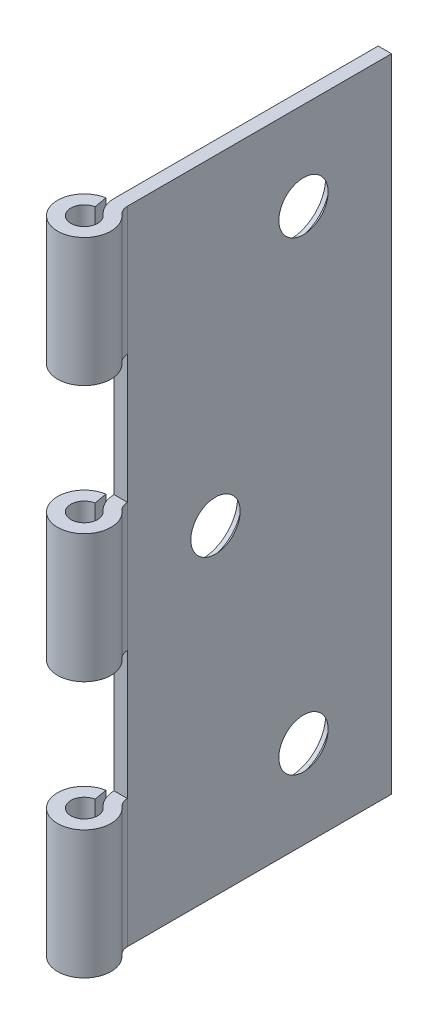
ISO-10303-21;
HEADER;
FILE_DESCRIPTION(('STEP AP214'),'2;1');
FILE_NAME('part.step','',(''),(''),'','','');
FILE_SCHEMA(('AUTOMOTIVE_DESIGN { 1 0 10303 214 1 1 1 1 }'));
ENDSEC;
DATA;
#1=APPLICATION_CONTEXT('core data for automotive mechanical design processes');
#2=APPLICATION_PROTOCOL_DEFINITION('international standard','automotive_design',2000,#1);
#3=PRODUCT_CONTEXT('',#1,'mechanical');
#4=PRODUCT('Part','Part','',(#3));
#5=PRODUCT_RELATED_PRODUCT_CATEGORY('part','',(#4));
#6=PRODUCT_DEFINITION_FORMATION('','',#4);
#7=PRODUCT_DEFINITION_CONTEXT('part definition',#1,'design');
#8=PRODUCT_DEFINITION('design','',#6,#7);
#9=PRODUCT_DEFINITION_SHAPE('','',#8);
#10=(LENGTH_UNIT() NAMED_UNIT(*) SI_UNIT(.MILLI.,.METRE.));
#11=(NAMED_UNIT(*) PLANE_ANGLE_UNIT() SI_UNIT($,.RADIAN.));
#12=(NAMED_UNIT(*) SI_UNIT($,.STERADIAN.) SOLID_ANGLE_UNIT());
#13=UNCERTAINTY_MEASURE_WITH_UNIT(LENGTH_MEASURE(1.E-05),#10,'distance_accuracy_value','');
#14=(GEOMETRIC_REPRESENTATION_CONTEXT(3) GLOBAL_UNCERTAINTY_ASSIGNED_CONTEXT((#13)) GLOBAL_UNIT_ASSIGNED_CONTEXT((#10,
#11,#12)) REPRESENTATION_CONTEXT('',''));
#15=CARTESIAN_POINT('',(0.,0.,0.));
#16=DIRECTION('',(0.,0.,1.));
#17=DIRECTION('',(1.,0.,0.));
#18=AXIS2_PLACEMENT_3D('',#15,#16,#17);
#19=CARTESIAN_POINT('',(3.175,38.1,-3.54975791428091));
#20=DIRECTION('',(0.,-1.,0.));
#21=DIRECTION('',(0.,0.,-1.));
#22=AXIS2_PLACEMENT_3D('',#19,#20,#21);
#23=CYLINDRICAL_SURFACE('',#22,3.175);
#24=DIRECTION('',(0.,-1.,0.));
#25=VECTOR('',#24,1.);
#26=CARTESIAN_POINT('',(0.,38.1,-3.54975791428091));
#27=LINE('',#26,#25);
#28=CARTESIAN_POINT('',(0.,7.62000000000002,-3.54975791428091));
#29=VERTEX_POINT('',#28);
#30=CARTESIAN_POINT('',(0.,-7.61999999999995,-3.54975791428091));
#31=VERTEX_POINT('',#30);
#32=EDGE_CURVE('E372',#29,#31,#27,.T.);
#33=ORIENTED_EDGE('',*,*,#32,.T.);
#34=CARTESIAN_POINT('',(3.175,-7.61999999999997,-3.54975791428091));
#35=DIRECTION('',(0.,1.,0.));
#36=DIRECTION('',(0.,0.,1.));
#37=AXIS2_PLACEMENT_3D('',#34,#35,#36);
#38=CIRCLE('',#37,3.175);
#39=CARTESIAN_POINT('',(1.05833333333333,-7.61999999999997,-1.18325263809364));
#40=VERTEX_POINT('',#39);
#41=EDGE_CURVE('E188',#31,#40,#38,.T.);
#42=ORIENTED_EDGE('',*,*,#41,.T.);
#43=DIRECTION('',(0.,-1.,0.));
#44=VECTOR('',#43,1.);
#45=CARTESIAN_POINT('',(1.05833333333333,38.1,-1.18325263809364));
#46=LINE('',#45,#44);
#47=CARTESIAN_POINT('',(1.05833333333333,7.62000000000002,-1.18325263809364));
#48=VERTEX_POINT('',#47);
#49=EDGE_CURVE('E229',#48,#40,#46,.T.);
#50=ORIENTED_EDGE('',*,*,#49,.F.);
#51=CARTESIAN_POINT('',(3.175,7.62000000000002,-3.54975791428091));
#52=DIRECTION('',(0.,-1.,0.));
#53=DIRECTION('',(0.,0.,-1.));
#54=AXIS2_PLACEMENT_3D('',#51,#52,#53);
#55=CIRCLE('',#54,3.175);
#56=EDGE_CURVE('E289',#48,#29,#55,.T.);
#57=ORIENTED_EDGE('',*,*,#56,.T.);
#58=EDGE_LOOP('',(#33,#42,#50,#57));
#59=FACE_BOUND('',#58,.T.);
#60=ADVANCED_FACE('F36',(#59),#23,.T.);
#61=CARTESIAN_POINT('',(0.,38.1,0.));
#62=DIRECTION('',(0.,-1.,0.));
#63=DIRECTION('',(0.,0.,-1.));
#64=AXIS2_PLACEMENT_3D('',#61,#62,#63);
#65=CYLINDRICAL_SURFACE('',#64,1.5875);
#66=ORIENTED_EDGE('',*,*,#49,.T.);
#67=CARTESIAN_POINT('',(0.,-7.61999999999997,0.));
#68=DIRECTION('',(0.,1.,0.));
#69=DIRECTION('',(0.,0.,1.));
#70=AXIS2_PLACEMENT_3D('',#67,#68,#69);
#71=CIRCLE('',#70,1.5875);
#72=CARTESIAN_POINT('',(-0.275666482046241,-7.61999999999997,-1.56338230790688));
#73=VERTEX_POINT('',#72);
#74=EDGE_CURVE('E272',#40,#73,#71,.F.);
#75=ORIENTED_EDGE('',*,*,#74,.T.);
#76=DIRECTION('',(0.,-1.,0.));
#77=VECTOR('',#76,1.);
#78=CARTESIAN_POINT('',(-0.275666482046241,38.1,-1.56338230790688));
#79=LINE('',#78,#77);
#80=CARTESIAN_POINT('',(-0.275666482046241,7.62000000000002,-1.56338230790688));
#81=VERTEX_POINT('',#80);
#82=EDGE_CURVE('E224',#81,#73,#79,.T.);
#83=ORIENTED_EDGE('',*,*,#82,.F.);
#84=CARTESIAN_POINT('',(0.,7.62000000000002,0.));
#85=DIRECTION('',(0.,-1.,0.));
#86=DIRECTION('',(0.,0.,-1.));
#87=AXIS2_PLACEMENT_3D('',#84,#85,#86);
#88=CIRCLE('',#87,1.5875);
#89=EDGE_CURVE('E286',#81,#48,#88,.F.);
#90=ORIENTED_EDGE('',*,*,#89,.T.);
#91=EDGE_LOOP('',(#66,#75,#83,#90));
#92=FACE_BOUND('',#91,.T.);
#93=ADVANCED_FACE('F396',(#92),#65,.F.);
#94=CARTESIAN_POINT('',(0.,38.1,0.));
#95=DIRECTION('',(0.984807753012209,0.,-0.173648177666924));
#96=DIRECTION('',(-0.173648177666924,0.,-0.984807753012209));
#97=AXIS2_PLACEMENT_3D('',#94,#95,#96);
#98=PLANE('',#97);
#99=DIRECTION('',(0.173648177666924,0.,0.984807753012209));
#100=VECTOR('',#99,1.);
#101=CARTESIAN_POINT('',(0.,-7.61999999999997,0.));
#102=LINE('',#101,#100);
#103=CARTESIAN_POINT('',(-0.551332964092483,-7.61999999999997,-3.12676461581376));
#104=VERTEX_POINT('',#103);
#105=EDGE_CURVE('E270',#104,#73,#102,.T.);
#106=ORIENTED_EDGE('',*,*,#105,.F.);
#107=DIRECTION('',(0.,-1.,0.));
#108=VECTOR('',#107,1.);
#109=CARTESIAN_POINT('',(-0.551332964092483,38.1,-3.12676461581376));
#110=LINE('',#109,#108);
#111=CARTESIAN_POINT('',(-0.551332964092483,7.62000000000002,-3.12676461581376));
#112=VERTEX_POINT('',#111);
#113=EDGE_CURVE('E219',#112,#104,#110,.T.);
#114=ORIENTED_EDGE('',*,*,#113,.F.);
#115=DIRECTION('',(-0.173648177666924,0.,-0.984807753012209));
#116=VECTOR('',#115,1.);
#117=CARTESIAN_POINT('',(0.,7.62000000000002,0.));
#118=LINE('',#117,#116);
#119=EDGE_CURVE('E283',#81,#112,#118,.T.);
#120=ORIENTED_EDGE('',*,*,#119,.F.);
#121=ORIENTED_EDGE('',*,*,#82,.T.);
#122=EDGE_LOOP('',(#106,#114,#120,#121));
#123=FACE_BOUND('',#122,.T.);
#124=ADVANCED_FACE('F433',(#123),#98,.T.);
#125=CARTESIAN_POINT('',(0.,38.1,0.));
#126=DIRECTION('',(0.,-1.,0.));
#127=DIRECTION('',(0.,0.,-1.));
#128=AXIS2_PLACEMENT_3D('',#125,#126,#127);
#129=CYLINDRICAL_SURFACE('',#128,3.175);
#130=ORIENTED_EDGE('',*,*,#113,.T.);
#131=CARTESIAN_POINT('',(0.,-7.61999999999997,0.));
#132=DIRECTION('',(0.,1.,0.));
#133=DIRECTION('',(0.,0.,1.));
#134=AXIS2_PLACEMENT_3D('',#131,#132,#133);
#135=CIRCLE('',#134,3.175);
#136=CARTESIAN_POINT('',(2.11666666666667,-7.61999999999997,-2.36650527618728));
#137=VERTEX_POINT('',#136);
#138=EDGE_CURVE('E268',#137,#104,#135,.F.);
#139=ORIENTED_EDGE('',*,*,#138,.F.);
#140=DIRECTION('',(0.,-1.,0.));
#141=VECTOR('',#140,1.);
#142=CARTESIAN_POINT('',(2.11666666666667,38.1,-2.36650527618728));
#143=LINE('',#142,#141);
#144=CARTESIAN_POINT('',(2.11666666666667,7.62000000000002,-2.36650527618728));
#145=VERTEX_POINT('',#144);
#146=EDGE_CURVE('E198',#145,#137,#143,.T.);
#147=ORIENTED_EDGE('',*,*,#146,.F.);
#148=CARTESIAN_POINT('',(0.,7.62000000000002,0.));
#149=DIRECTION('',(0.,-1.,0.));
#150=DIRECTION('',(0.,0.,-1.));
#151=AXIS2_PLACEMENT_3D('',#148,#149,#150);
#152=CIRCLE('',#151,3.175);
#153=EDGE_CURVE('E281',#112,#145,#152,.F.);
#154=ORIENTED_EDGE('',*,*,#153,.F.);
#155=EDGE_LOOP('',(#130,#139,#147,#154));
#156=FACE_BOUND('',#155,.T.);
#157=ADVANCED_FACE('F411',(#156),#129,.T.);
#158=CARTESIAN_POINT('',(3.175,38.1,-3.54975791428091));
#159=DIRECTION('',(0.,-1.,0.));
#160=DIRECTION('',(0.,0.,-1.));
#161=AXIS2_PLACEMENT_3D('',#158,#159,#160);
#162=CYLINDRICAL_SURFACE('',#161,1.5875);
#163=CARTESIAN_POINT('',(3.175,-7.61999999999997,-3.54975791428091));
#164=DIRECTION('',(0.,1.,0.));
#165=DIRECTION('',(0.,0.,1.));
#166=AXIS2_PLACEMENT_3D('',#163,#164,#165);
#167=CIRCLE('',#166,1.5875);
#168=CARTESIAN_POINT('',(1.5875,-7.61999999999997,-3.54975791428091));
#169=VERTEX_POINT('',#168);
#170=EDGE_CURVE('E11',#169,#137,#167,.T.);
#171=ORIENTED_EDGE('',*,*,#170,.F.);
#172=DIRECTION('',(0.,-1.,0.));
#173=VECTOR('',#172,1.);
#174=CARTESIAN_POINT('',(1.5875,38.1,-3.54975791428091));
#175=LINE('',#174,#173);
#176=CARTESIAN_POINT('',(1.5875,7.62000000000002,-3.54975791428091));
#177=VERTEX_POINT('',#176);
#178=EDGE_CURVE('E195',#177,#169,#175,.T.);
#179=ORIENTED_EDGE('',*,*,#178,.F.);
#180=CARTESIAN_POINT('',(3.175,7.62000000000002,-3.54975791428091));
#181=DIRECTION('',(0.,-1.,0.));
#182=DIRECTION('',(0.,0.,-1.));
#183=AXIS2_PLACEMENT_3D('',#180,#181,#182);
#184=CIRCLE('',#183,1.5875);
#185=EDGE_CURVE('E228',#145,#177,#184,.T.);
#186=ORIENTED_EDGE('',*,*,#185,.F.);
#187=ORIENTED_EDGE('',*,*,#146,.T.);
#188=EDGE_LOOP('',(#171,#179,#186,#187));
#189=FACE_BOUND('',#188,.T.);
#190=ADVANCED_FACE('F193',(#189),#162,.F.);
#191=CARTESIAN_POINT('',(0.,38.1,-3.54975791428091));
#192=VERTEX_POINT('',#191);
#193=CARTESIAN_POINT('',(0.,22.86,-3.54975791428091));
#194=VERTEX_POINT('',#193);
#195=EDGE_CURVE('E349',#192,#194,#27,.T.);
#196=ORIENTED_EDGE('',*,*,#195,.T.);
#197=CARTESIAN_POINT('',(3.175,22.86,-3.54975791428091));
#198=DIRECTION('',(0.,1.,0.));
#199=DIRECTION('',(0.,0.,1.));
#200=AXIS2_PLACEMENT_3D('',#197,#198,#199);
#201=CIRCLE('',#200,3.175);
#202=CARTESIAN_POINT('',(1.05833333333333,22.86,-1.18325263809364));
#203=VERTEX_POINT('',#202);
#204=EDGE_CURVE('E299',#194,#203,#201,.T.);
#205=ORIENTED_EDGE('',*,*,#204,.T.);
#206=CARTESIAN_POINT('',(1.05833333333333,38.1,-1.18325263809364));
#207=VERTEX_POINT('',#206);
#208=EDGE_CURVE('E225',#207,#203,#46,.T.);
#209=ORIENTED_EDGE('',*,*,#208,.F.);
#210=CARTESIAN_POINT('',(3.175,38.1,-3.54975791428091));
#211=DIRECTION('',(0.,1.,0.));
#212=DIRECTION('',(0.,0.,1.));
#213=AXIS2_PLACEMENT_3D('',#210,#211,#212);
#214=CIRCLE('',#213,3.175);
#215=EDGE_CURVE('E303',#192,#207,#214,.T.);
#216=ORIENTED_EDGE('',*,*,#215,.F.);
#217=EDGE_LOOP('',(#196,#205,#209,#216));
#218=FACE_BOUND('',#217,.T.);
#219=ADVANCED_FACE('F390',(#218),#23,.T.);
#220=ORIENTED_EDGE('',*,*,#208,.T.);
#221=CARTESIAN_POINT('',(0.,22.86,0.));
#222=DIRECTION('',(0.,1.,0.));
#223=DIRECTION('',(0.,0.,1.));
#224=AXIS2_PLACEMENT_3D('',#221,#222,#223);
#225=CIRCLE('',#224,1.5875);
#226=CARTESIAN_POINT('',(-0.275666482046241,22.86,-1.56338230790688));
#227=VERTEX_POINT('',#226);
#228=EDGE_CURVE('E296',#203,#227,#225,.F.);
#229=ORIENTED_EDGE('',*,*,#228,.T.);
#230=CARTESIAN_POINT('',(-0.275666482046241,38.1,-1.56338230790688));
#231=VERTEX_POINT('',#230);
#232=EDGE_CURVE('E220',#231,#227,#79,.T.);
#233=ORIENTED_EDGE('',*,*,#232,.F.);
#234=CARTESIAN_POINT('',(0.,38.1,0.));
#235=DIRECTION('',(0.,1.,0.));
#236=DIRECTION('',(0.,0.,1.));
#237=AXIS2_PLACEMENT_3D('',#234,#235,#236);
#238=CIRCLE('',#237,1.5875);
#239=EDGE_CURVE('E306',#207,#231,#238,.F.);
#240=ORIENTED_EDGE('',*,*,#239,.F.);
#241=EDGE_LOOP('',(#220,#229,#233,#240));
#242=FACE_BOUND('',#241,.T.);
#243=ADVANCED_FACE('F397',(#242),#65,.F.);
#244=DIRECTION('',(0.173648177666924,0.,0.984807753012209));
#245=VECTOR('',#244,1.);
#246=CARTESIAN_POINT('',(0.,22.86,0.));
#247=LINE('',#246,#245);
#248=CARTESIAN_POINT('',(-0.551332964092483,22.86,-3.12676461581376));
#249=VERTEX_POINT('',#248);
#250=EDGE_CURVE('E294',#249,#227,#247,.T.);
#251=ORIENTED_EDGE('',*,*,#250,.F.);
#252=CARTESIAN_POINT('',(-0.551332964092483,38.1,-3.12676461581376));
#253=VERTEX_POINT('',#252);
#254=EDGE_CURVE('E215',#253,#249,#110,.T.);
#255=ORIENTED_EDGE('',*,*,#254,.F.);
#256=DIRECTION('',(0.173648177666924,0.,0.984807753012209));
#257=VECTOR('',#256,1.);
#258=CARTESIAN_POINT('',(0.,38.1,0.));
#259=LINE('',#258,#257);
#260=EDGE_CURVE('E309',#253,#231,#259,.T.);
#261=ORIENTED_EDGE('',*,*,#260,.T.);
#262=ORIENTED_EDGE('',*,*,#232,.T.);
#263=EDGE_LOOP('',(#251,#255,#261,#262));
#264=FACE_BOUND('',#263,.T.);
#265=ADVANCED_FACE('F409',(#264),#98,.T.);
#266=ORIENTED_EDGE('',*,*,#254,.T.);
#267=CARTESIAN_POINT('',(0.,22.86,0.));
#268=DIRECTION('',(0.,1.,0.));
#269=DIRECTION('',(0.,0.,1.));
#270=AXIS2_PLACEMENT_3D('',#267,#268,#269);
#271=CIRCLE('',#270,3.175);
#272=CARTESIAN_POINT('',(2.11666666666667,22.86,-2.36650527618728));
#273=VERTEX_POINT('',#272);
#274=EDGE_CURVE('E292',#273,#249,#271,.F.);
#275=ORIENTED_EDGE('',*,*,#274,.F.);
#276=CARTESIAN_POINT('',(2.11666666666667,38.1,-2.36650527618728));
#277=VERTEX_POINT('',#276);
#278=EDGE_CURVE('E211',#277,#273,#143,.T.);
#279=ORIENTED_EDGE('',*,*,#278,.F.);
#280=CARTESIAN_POINT('',(0.,38.1,0.));
#281=DIRECTION('',(0.,1.,0.));
#282=DIRECTION('',(0.,0.,1.));
#283=AXIS2_PLACEMENT_3D('',#280,#281,#282);
#284=CIRCLE('',#283,3.175);
#285=EDGE_CURVE('E312',#277,#253,#284,.F.);
#286=ORIENTED_EDGE('',*,*,#285,.T.);
#287=EDGE_LOOP('',(#266,#275,#279,#286));
#288=FACE_BOUND('',#287,.T.);
#289=ADVANCED_FACE('F398',(#288),#129,.T.);
#290=CARTESIAN_POINT('',(3.175,22.86,-3.54975791428091));
#291=DIRECTION('',(0.,1.,0.));
#292=DIRECTION('',(0.,0.,1.));
#293=AXIS2_PLACEMENT_3D('',#290,#291,#292);
#294=CIRCLE('',#293,1.5875);
#295=CARTESIAN_POINT('',(1.5875,22.86,-3.5497579142809));
#296=VERTEX_POINT('',#295);
#297=EDGE_CURVE('E231',#296,#273,#294,.T.);
#298=ORIENTED_EDGE('',*,*,#297,.F.);
#299=CARTESIAN_POINT('',(1.5875,38.1,-3.54975791428091));
#300=VERTEX_POINT('',#299);
#301=EDGE_CURVE('E203',#300,#296,#175,.T.);
#302=ORIENTED_EDGE('',*,*,#301,.F.);
#303=CARTESIAN_POINT('',(3.175,38.1,-3.54975791428091));
#304=DIRECTION('',(0.,1.,0.));
#305=DIRECTION('',(0.,0.,1.));
#306=AXIS2_PLACEMENT_3D('',#303,#304,#305);
#307=CIRCLE('',#306,1.5875);
#308=EDGE_CURVE('E315',#300,#277,#307,.T.);
#309=ORIENTED_EDGE('',*,*,#308,.T.);
#310=ORIENTED_EDGE('',*,*,#278,.T.);
#311=EDGE_LOOP('',(#298,#302,#309,#310));
#312=FACE_BOUND('',#311,.T.);
#313=ADVANCED_FACE('F389',(#312),#162,.F.);
#314=CARTESIAN_POINT('',(1.05833333333333,-22.86,-1.18325263809364));
#315=VERTEX_POINT('',#314);
#316=CARTESIAN_POINT('',(1.05833333333333,-38.1,-1.18325263809364));
#317=VERTEX_POINT('',#316);
#318=EDGE_CURVE('E223',#315,#317,#46,.T.);
#319=ORIENTED_EDGE('',*,*,#318,.F.);
#320=CARTESIAN_POINT('',(3.175,-22.86,-3.54975791428091));
#321=DIRECTION('',(0.,-1.,0.));
#322=DIRECTION('',(0.,0.,-1.));
#323=AXIS2_PLACEMENT_3D('',#320,#321,#322);
#324=CIRCLE('',#323,3.175);
#325=CARTESIAN_POINT('',(0.,-22.86,-3.54975791428091));
#326=VERTEX_POINT('',#325);
#327=EDGE_CURVE('E265',#315,#326,#324,.T.);
#328=ORIENTED_EDGE('',*,*,#327,.T.);
#329=CARTESIAN_POINT('',(0.,-38.1,-3.54975791428091));
#330=VERTEX_POINT('',#329);
#331=EDGE_CURVE('E326',#326,#330,#27,.T.);
#332=ORIENTED_EDGE('',*,*,#331,.T.);
#333=CARTESIAN_POINT('',(3.175,-38.1,-3.54975791428091));
#334=DIRECTION('',(0.,1.,0.));
#335=DIRECTION('',(0.,0.,1.));
#336=AXIS2_PLACEMENT_3D('',#333,#334,#335);
#337=CIRCLE('',#336,3.175);
#338=EDGE_CURVE('E302',#330,#317,#337,.T.);
#339=ORIENTED_EDGE('',*,*,#338,.T.);
#340=EDGE_LOOP('',(#319,#328,#332,#339));
#341=FACE_BOUND('',#340,.T.);
#342=ADVANCED_FACE('F38',(#341),#23,.T.);
#343=CARTESIAN_POINT('',(-0.275666482046241,-22.86,-1.56338230790688));
#344=VERTEX_POINT('',#343);
#345=CARTESIAN_POINT('',(-0.275666482046241,-38.1,-1.56338230790688));
#346=VERTEX_POINT('',#345);
#347=EDGE_CURVE('E218',#344,#346,#79,.T.);
#348=ORIENTED_EDGE('',*,*,#347,.F.);
#349=CARTESIAN_POINT('',(0.,-22.86,0.));
#350=DIRECTION('',(0.,-1.,0.));
#351=DIRECTION('',(0.,0.,-1.));
#352=AXIS2_PLACEMENT_3D('',#349,#350,#351);
#353=CIRCLE('',#352,1.5875);
#354=EDGE_CURVE('E262',#344,#315,#353,.F.);
#355=ORIENTED_EDGE('',*,*,#354,.T.);
#356=ORIENTED_EDGE('',*,*,#318,.T.);
#357=CARTESIAN_POINT('',(0.,-38.1,0.));
#358=DIRECTION('',(0.,1.,0.));
#359=DIRECTION('',(0.,0.,1.));
#360=AXIS2_PLACEMENT_3D('',#357,#358,#359);
#361=CIRCLE('',#360,1.5875);
#362=EDGE_CURVE('E329',#317,#346,#361,.F.);
#363=ORIENTED_EDGE('',*,*,#362,.T.);
#364=EDGE_LOOP('',(#348,#355,#356,#363));
#365=FACE_BOUND('',#364,.T.);
#366=ADVANCED_FACE('F386',(#365),#65,.F.);
#367=DIRECTION('',(-0.173648177666924,0.,-0.984807753012209));
#368=VECTOR('',#367,1.);
#369=CARTESIAN_POINT('',(0.,-22.86,0.));
#370=LINE('',#369,#368);
#371=CARTESIAN_POINT('',(-0.551332964092483,-22.86,-3.12676461581376));
#372=VERTEX_POINT('',#371);
#373=EDGE_CURVE('E259',#344,#372,#370,.T.);
#374=ORIENTED_EDGE('',*,*,#373,.F.);
#375=ORIENTED_EDGE('',*,*,#347,.T.);
#376=DIRECTION('',(0.173648177666924,0.,0.984807753012209));
#377=VECTOR('',#376,1.);
#378=CARTESIAN_POINT('',(0.,-38.1,0.));
#379=LINE('',#378,#377);
#380=CARTESIAN_POINT('',(-0.551332964092483,-38.1,-3.12676461581376));
#381=VERTEX_POINT('',#380);
#382=EDGE_CURVE('E332',#381,#346,#379,.T.);
#383=ORIENTED_EDGE('',*,*,#382,.F.);
#384=EDGE_CURVE('E214',#372,#381,#110,.T.);
#385=ORIENTED_EDGE('',*,*,#384,.F.);
#386=EDGE_LOOP('',(#374,#375,#383,#385));
#387=FACE_BOUND('',#386,.T.);
#388=ADVANCED_FACE('F395',(#387),#98,.T.);
#389=CARTESIAN_POINT('',(0.,-22.86,0.));
#390=DIRECTION('',(0.,-1.,0.));
#391=DIRECTION('',(0.,0.,-1.));
#392=AXIS2_PLACEMENT_3D('',#389,#390,#391);
#393=CIRCLE('',#392,3.175);
#394=CARTESIAN_POINT('',(2.11666666666667,-22.86,-2.36650527618728));
#395=VERTEX_POINT('',#394);
#396=EDGE_CURVE('E181',#372,#395,#393,.F.);
#397=ORIENTED_EDGE('',*,*,#396,.F.);
#398=ORIENTED_EDGE('',*,*,#384,.T.);
#399=CARTESIAN_POINT('',(0.,-38.1,0.));
#400=DIRECTION('',(0.,1.,0.));
#401=DIRECTION('',(0.,0.,1.));
#402=AXIS2_PLACEMENT_3D('',#399,#400,#401);
#403=CIRCLE('',#402,3.175);
#404=CARTESIAN_POINT('',(2.11666666666667,-38.1,-2.36650527618728));
#405=VERTEX_POINT('',#404);
#406=EDGE_CURVE('E335',#405,#381,#403,.F.);
#407=ORIENTED_EDGE('',*,*,#406,.F.);
#408=EDGE_CURVE('E206',#395,#405,#143,.T.);
#409=ORIENTED_EDGE('',*,*,#408,.F.);
#410=EDGE_LOOP('',(#397,#398,#407,#409));
#411=FACE_BOUND('',#410,.T.);
#412=ADVANCED_FACE('F428',(#411),#129,.T.);
#413=CARTESIAN_POINT('',(3.175,-22.86,-3.54975791428091));
#414=DIRECTION('',(0.,-1.,0.));
#415=DIRECTION('',(0.,0.,-1.));
#416=AXIS2_PLACEMENT_3D('',#413,#414,#415);
#417=CIRCLE('',#416,1.5875);
#418=CARTESIAN_POINT('',(1.5875,-22.86,-3.54975791428091));
#419=VERTEX_POINT('',#418);
#420=EDGE_CURVE('E45',#395,#419,#417,.T.);
#421=ORIENTED_EDGE('',*,*,#420,.F.);
#422=ORIENTED_EDGE('',*,*,#408,.T.);
#423=CARTESIAN_POINT('',(3.175,-38.1,-3.54975791428091));
#424=DIRECTION('',(0.,1.,0.));
#425=DIRECTION('',(0.,0.,1.));
#426=AXIS2_PLACEMENT_3D('',#423,#424,#425);
#427=CIRCLE('',#426,1.5875);
#428=CARTESIAN_POINT('',(1.5875,-38.1,-3.54975791428091));
#429=VERTEX_POINT('',#428);
#430=EDGE_CURVE('E338',#429,#405,#427,.T.);
#431=ORIENTED_EDGE('',*,*,#430,.F.);
#432=EDGE_CURVE('E204',#419,#429,#175,.T.);
#433=ORIENTED_EDGE('',*,*,#432,.F.);
#434=EDGE_LOOP('',(#421,#422,#431,#433));
#435=FACE_BOUND('',#434,.T.);
#436=ADVANCED_FACE('F401',(#435),#162,.F.);
#437=CARTESIAN_POINT('',(1.5875,38.1,0.));
#438=DIRECTION('',(1.,0.,0.));
#439=DIRECTION('',(0.,0.,-1.));
#440=AXIS2_PLACEMENT_3D('',#437,#438,#439);
#441=PLANE('',#440);
#442=CARTESIAN_POINT('',(1.5875,-27.641585971427,-24.466585971427));
#443=DIRECTION('',(1.,0.,0.));
#444=DIRECTION('',(0.,0.,-1.));
#445=AXIS2_PLACEMENT_3D('',#442,#443,#444);
#446=CIRCLE('',#445,2.92990199679455);
#447=CARTESIAN_POINT('',(1.5875,-27.641585971427,-27.3964879682215));
#448=VERTEX_POINT('',#447);
#449=EDGE_CURVE('E40',#448,#448,#446,.T.);
#450=ORIENTED_EDGE('',*,*,#449,.F.);
#451=EDGE_LOOP('',(#450));
#452=FACE_BOUND('',#451,.T.);
#453=CARTESIAN_POINT('',(1.5875,0.,-14.0081719428539));
#454=DIRECTION('',(1.,0.,0.));
#455=DIRECTION('',(0.,0.,-1.));
#456=AXIS2_PLACEMENT_3D('',#453,#454,#455);
#457=CIRCLE('',#456,2.92990199679455);
#458=CARTESIAN_POINT('',(1.5875,0.,-16.9380739396485));
#459=VERTEX_POINT('',#458);
#460=EDGE_CURVE('E238',#459,#459,#457,.T.);
#461=ORIENTED_EDGE('',*,*,#460,.F.);
#462=EDGE_LOOP('',(#461));
#463=FACE_BOUND('',#462,.T.);
#464=CARTESIAN_POINT('',(1.5875,27.641585971427,-24.466585971427));
#465=DIRECTION('',(1.,0.,0.));
#466=DIRECTION('',(0.,0.,-1.));
#467=AXIS2_PLACEMENT_3D('',#464,#465,#466);
#468=CIRCLE('',#467,2.92990199679455);
#469=CARTESIAN_POINT('',(1.5875,27.641585971427,-27.3964879682215));
#470=VERTEX_POINT('',#469);
#471=EDGE_CURVE('E235',#470,#470,#468,.T.);
#472=ORIENTED_EDGE('',*,*,#471,.F.);
#473=EDGE_LOOP('',(#472));
#474=FACE_BOUND('',#473,.T.);
#475=DIRECTION('',(0.,0.,1.));
#476=VECTOR('',#475,1.);
#477=CARTESIAN_POINT('',(1.5875,-38.1,0.));
#478=LINE('',#477,#476);
#479=CARTESIAN_POINT('',(1.5875,-38.1,-34.925));
#480=VERTEX_POINT('',#479);
#481=EDGE_CURVE('E341',#480,#429,#478,.T.);
#482=ORIENTED_EDGE('',*,*,#481,.F.);
#483=DIRECTION('',(0.,-1.,0.));
#484=VECTOR('',#483,1.);
#485=CARTESIAN_POINT('',(1.5875,38.1,-34.925));
#486=LINE('',#485,#484);
#487=CARTESIAN_POINT('',(1.5875,38.1,-34.925));
#488=VERTEX_POINT('',#487);
#489=EDGE_CURVE('E207',#488,#480,#486,.T.);
#490=ORIENTED_EDGE('',*,*,#489,.F.);
#491=DIRECTION('',(0.,0.,1.));
#492=VECTOR('',#491,1.);
#493=CARTESIAN_POINT('',(1.5875,38.1,0.));
#494=LINE('',#493,#492);
#495=EDGE_CURVE('E318',#488,#300,#494,.T.);
#496=ORIENTED_EDGE('',*,*,#495,.T.);
#497=ORIENTED_EDGE('',*,*,#301,.T.);
#498=DIRECTION('',(0.,1.,0.));
#499=VECTOR('',#498,1.);
#500=CARTESIAN_POINT('',(1.5875,38.1,-3.5497579142809));
#501=LINE('',#500,#499);
#502=EDGE_CURVE('E202',#177,#296,#501,.T.);
#503=ORIENTED_EDGE('',*,*,#502,.F.);
#504=ORIENTED_EDGE('',*,*,#178,.T.);
#505=DIRECTION('',(0.,1.,0.));
#506=VECTOR('',#505,1.);
#507=CARTESIAN_POINT('',(1.5875,38.1,-3.5497579142809));
#508=LINE('',#507,#506);
#509=EDGE_CURVE('E174',#419,#169,#508,.T.);
#510=ORIENTED_EDGE('',*,*,#509,.F.);
#511=ORIENTED_EDGE('',*,*,#432,.T.);
#512=EDGE_LOOP('',(#482,#490,#496,#497,#503,#504,#510,#511));
#513=FACE_BOUND('',#512,.T.);
#514=ADVANCED_FACE('F200',(#452,#463,#474,#513),#441,.T.);
#515=CARTESIAN_POINT('',(0.,38.1,-34.925));
#516=DIRECTION('',(0.,0.,-1.));
#517=DIRECTION('',(-1.,0.,0.));
#518=AXIS2_PLACEMENT_3D('',#515,#516,#517);
#519=PLANE('',#518);
#520=DIRECTION('',(1.,0.,0.));
#521=VECTOR('',#520,1.);
#522=CARTESIAN_POINT('',(0.,-38.1,-34.925));
#523=LINE('',#522,#521);
#524=CARTESIAN_POINT('',(0.,-38.1,-34.925));
#525=VERTEX_POINT('',#524);
#526=EDGE_CURVE('E344',#525,#480,#523,.T.);
#527=ORIENTED_EDGE('',*,*,#526,.F.);
#528=DIRECTION('',(0.,-1.,0.));
#529=VECTOR('',#528,1.);
#530=CARTESIAN_POINT('',(0.,38.1,-34.925));
#531=LINE('',#530,#529);
#532=CARTESIAN_POINT('',(0.,38.1,-34.925));
#533=VERTEX_POINT('',#532);
#534=EDGE_CURVE('E351',#533,#525,#531,.T.);
#535=ORIENTED_EDGE('',*,*,#534,.F.);
#536=DIRECTION('',(1.,0.,0.));
#537=VECTOR('',#536,1.);
#538=CARTESIAN_POINT('',(0.,38.1,-34.925));
#539=LINE('',#538,#537);
#540=EDGE_CURVE('E321',#533,#488,#539,.T.);
#541=ORIENTED_EDGE('',*,*,#540,.T.);
#542=ORIENTED_EDGE('',*,*,#489,.T.);
#543=EDGE_LOOP('',(#527,#535,#541,#542));
#544=FACE_BOUND('',#543,.T.);
#545=ADVANCED_FACE('F358',(#544),#519,.T.);
#546=CARTESIAN_POINT('',(0.,38.1,0.));
#547=DIRECTION('',(1.,0.,0.));
#548=DIRECTION('',(0.,0.,-1.));
#549=AXIS2_PLACEMENT_3D('',#546,#547,#548);
#550=PLANE('',#549);
#551=CARTESIAN_POINT('',(0.,-27.641585971427,-24.466585971427));
#552=DIRECTION('',(-1.,0.,0.));
#553=DIRECTION('',(0.,0.,1.));
#554=AXIS2_PLACEMENT_3D('',#551,#552,#553);
#555=CIRCLE('',#554,4.2164);
#556=CARTESIAN_POINT('',(0.,-27.641585971427,-20.250185971427));
#557=VERTEX_POINT('',#556);
#558=EDGE_CURVE('E699',#557,#557,#555,.T.);
#559=ORIENTED_EDGE('',*,*,#558,.F.);
#560=EDGE_LOOP('',(#559));
#561=FACE_BOUND('',#560,.T.);
#562=CARTESIAN_POINT('',(0.,0.,-14.0081719428539));
#563=DIRECTION('',(-1.,0.,0.));
#564=DIRECTION('',(0.,0.,1.));
#565=AXIS2_PLACEMENT_3D('',#562,#563,#564);
#566=CIRCLE('',#565,4.2164);
#567=CARTESIAN_POINT('',(0.,0.,-9.79177194285394));
#568=VERTEX_POINT('',#567);
#569=EDGE_CURVE('E247',#568,#568,#566,.T.);
#570=ORIENTED_EDGE('',*,*,#569,.F.);
#571=EDGE_LOOP('',(#570));
#572=FACE_BOUND('',#571,.T.);
#573=CARTESIAN_POINT('',(0.,27.641585971427,-24.466585971427));
#574=DIRECTION('',(-1.,0.,0.));
#575=DIRECTION('',(0.,0.,1.));
#576=AXIS2_PLACEMENT_3D('',#573,#574,#575);
#577=CIRCLE('',#576,4.2164);
#578=CARTESIAN_POINT('',(0.,27.641585971427,-20.250185971427));
#579=VERTEX_POINT('',#578);
#580=EDGE_CURVE('E240',#579,#579,#577,.T.);
#581=ORIENTED_EDGE('',*,*,#580,.F.);
#582=EDGE_LOOP('',(#581));
#583=FACE_BOUND('',#582,.T.);
#584=DIRECTION('',(0.,0.,1.));
#585=VECTOR('',#584,1.);
#586=CARTESIAN_POINT('',(0.,-38.1,0.));
#587=LINE('',#586,#585);
#588=EDGE_CURVE('E307',#525,#330,#587,.T.);
#589=ORIENTED_EDGE('',*,*,#588,.T.);
#590=ORIENTED_EDGE('',*,*,#331,.F.);
#591=EDGE_CURVE('E369',#31,#326,#27,.T.);
#592=ORIENTED_EDGE('',*,*,#591,.F.);
#593=ORIENTED_EDGE('',*,*,#32,.F.);
#594=EDGE_CURVE('E352',#194,#29,#27,.T.);
#595=ORIENTED_EDGE('',*,*,#594,.F.);
#596=ORIENTED_EDGE('',*,*,#195,.F.);
#597=DIRECTION('',(0.,0.,1.));
#598=VECTOR('',#597,1.);
#599=CARTESIAN_POINT('',(0.,38.1,0.));
#600=LINE('',#599,#598);
#601=EDGE_CURVE('E324',#533,#192,#600,.T.);
#602=ORIENTED_EDGE('',*,*,#601,.F.);
#603=ORIENTED_EDGE('',*,*,#534,.T.);
#604=EDGE_LOOP('',(#589,#590,#592,#593,#595,#596,#602,#603));
#605=FACE_BOUND('',#604,.T.);
#606=ADVANCED_FACE('F367',(#561,#572,#583,#605),#550,.F.);
#607=CARTESIAN_POINT('',(0.,38.1,0.));
#608=DIRECTION('',(0.,1.,0.));
#609=DIRECTION('',(0.,0.,1.));
#610=AXIS2_PLACEMENT_3D('',#607,#608,#609);
#611=PLANE('',#610);
#612=ORIENTED_EDGE('',*,*,#215,.T.);
#613=ORIENTED_EDGE('',*,*,#239,.T.);
#614=ORIENTED_EDGE('',*,*,#260,.F.);
#615=ORIENTED_EDGE('',*,*,#285,.F.);
#616=ORIENTED_EDGE('',*,*,#308,.F.);
#617=ORIENTED_EDGE('',*,*,#495,.F.);
#618=ORIENTED_EDGE('',*,*,#540,.F.);
#619=ORIENTED_EDGE('',*,*,#601,.T.);
#620=EDGE_LOOP('',(#612,#613,#614,#615,#616,#617,#618,#619));
#621=FACE_BOUND('',#620,.T.);
#622=ADVANCED_FACE('F415',(#621),#611,.T.);
#623=CARTESIAN_POINT('',(0.,-38.1,0.));
#624=DIRECTION('',(0.,1.,0.));
#625=DIRECTION('',(0.,0.,1.));
#626=AXIS2_PLACEMENT_3D('',#623,#624,#625);
#627=PLANE('',#626);
#628=ORIENTED_EDGE('',*,*,#338,.F.);
#629=ORIENTED_EDGE('',*,*,#588,.F.);
#630=ORIENTED_EDGE('',*,*,#526,.T.);
#631=ORIENTED_EDGE('',*,*,#481,.T.);
#632=ORIENTED_EDGE('',*,*,#430,.T.);
#633=ORIENTED_EDGE('',*,*,#406,.T.);
#634=ORIENTED_EDGE('',*,*,#382,.T.);
#635=ORIENTED_EDGE('',*,*,#362,.F.);
#636=EDGE_LOOP('',(#628,#629,#630,#631,#632,#633,#634,#635));
#637=FACE_BOUND('',#636,.T.);
#638=ADVANCED_FACE('F364',(#637),#627,.F.);
#639=CARTESIAN_POINT('',(-3.175,22.86,-3.5497579142809));
#640=DIRECTION('',(0.,1.,0.));
#641=DIRECTION('',(0.,0.,1.));
#642=AXIS2_PLACEMENT_3D('',#639,#640,#641);
#643=PLANE('',#642);
#644=DIRECTION('',(1.,0.,0.));
#645=VECTOR('',#644,1.);
#646=CARTESIAN_POINT('',(-3.175,22.86,-3.5497579142809));
#647=LINE('',#646,#645);
#648=EDGE_CURVE('E61',#194,#296,#647,.T.);
#649=ORIENTED_EDGE('',*,*,#648,.T.);
#650=ORIENTED_EDGE('',*,*,#297,.T.);
#651=ORIENTED_EDGE('',*,*,#274,.T.);
#652=ORIENTED_EDGE('',*,*,#250,.T.);
#653=ORIENTED_EDGE('',*,*,#228,.F.);
#654=ORIENTED_EDGE('',*,*,#204,.F.);
#655=EDGE_LOOP('',(#649,#650,#651,#652,#653,#654));
#656=FACE_BOUND('',#655,.T.);
#657=ADVANCED_FACE('F420',(#656),#643,.F.);
#658=CARTESIAN_POINT('',(-3.175,7.62000000000002,-3.54975791428091));
#659=DIRECTION('',(0.,-1.,0.));
#660=DIRECTION('',(0.,0.,-1.));
#661=AXIS2_PLACEMENT_3D('',#658,#659,#660);
#662=PLANE('',#661);
#663=ORIENTED_EDGE('',*,*,#89,.F.);
#664=ORIENTED_EDGE('',*,*,#119,.T.);
#665=ORIENTED_EDGE('',*,*,#153,.T.);
#666=ORIENTED_EDGE('',*,*,#185,.T.);
#667=DIRECTION('',(1.,0.,0.));
#668=VECTOR('',#667,1.);
#669=CARTESIAN_POINT('',(-3.175,7.62000000000002,-3.54975791428091));
#670=LINE('',#669,#668);
#671=EDGE_CURVE('E276',#29,#177,#670,.T.);
#672=ORIENTED_EDGE('',*,*,#671,.F.);
#673=ORIENTED_EDGE('',*,*,#56,.F.);
#674=EDGE_LOOP('',(#663,#664,#665,#666,#672,#673));
#675=FACE_BOUND('',#674,.T.);
#676=ADVANCED_FACE('F379',(#675),#662,.F.);
#677=CARTESIAN_POINT('',(-3.175,22.86,-3.5497579142809));
#678=DIRECTION('',(0.,0.,-1.));
#679=DIRECTION('',(0.,1.,0.));
#680=AXIS2_PLACEMENT_3D('',#677,#678,#679);
#681=PLANE('',#680);
#682=ORIENTED_EDGE('',*,*,#502,.T.);
#683=ORIENTED_EDGE('',*,*,#648,.F.);
#684=ORIENTED_EDGE('',*,*,#594,.T.);
#685=ORIENTED_EDGE('',*,*,#671,.T.);
#686=EDGE_LOOP('',(#682,#683,#684,#685));
#687=FACE_BOUND('',#686,.T.);
#688=ADVANCED_FACE('F376',(#687),#681,.F.);
#689=CARTESIAN_POINT('',(-3.175,-7.61999999999997,-3.54975791428091));
#690=DIRECTION('',(0.,1.,0.));
#691=DIRECTION('',(0.,0.,1.));
#692=AXIS2_PLACEMENT_3D('',#689,#690,#691);
#693=PLANE('',#692);
#694=DIRECTION('',(1.,0.,0.));
#695=VECTOR('',#694,1.);
#696=CARTESIAN_POINT('',(-3.175,-7.61999999999997,-3.54975791428091));
#697=LINE('',#696,#695);
#698=EDGE_CURVE('E53',#31,#169,#697,.T.);
#699=ORIENTED_EDGE('',*,*,#698,.T.);
#700=ORIENTED_EDGE('',*,*,#170,.T.);
#701=ORIENTED_EDGE('',*,*,#138,.T.);
#702=ORIENTED_EDGE('',*,*,#105,.T.);
#703=ORIENTED_EDGE('',*,*,#74,.F.);
#704=ORIENTED_EDGE('',*,*,#41,.F.);
#705=EDGE_LOOP('',(#699,#700,#701,#702,#703,#704));
#706=FACE_BOUND('',#705,.T.);
#707=ADVANCED_FACE('F185',(#706),#693,.F.);
#708=CARTESIAN_POINT('',(-3.175,-22.86,-3.54975791428091));
#709=DIRECTION('',(0.,-1.,0.));
#710=DIRECTION('',(0.,0.,-1.));
#711=AXIS2_PLACEMENT_3D('',#708,#709,#710);
#712=PLANE('',#711);
#713=ORIENTED_EDGE('',*,*,#354,.F.);
#714=ORIENTED_EDGE('',*,*,#373,.T.);
#715=ORIENTED_EDGE('',*,*,#396,.T.);
#716=ORIENTED_EDGE('',*,*,#420,.T.);
#717=DIRECTION('',(1.,0.,0.));
#718=VECTOR('',#717,1.);
#719=CARTESIAN_POINT('',(-3.175,-22.86,-3.54975791428091));
#720=LINE('',#719,#718);
#721=EDGE_CURVE('E177',#326,#419,#720,.T.);
#722=ORIENTED_EDGE('',*,*,#721,.F.);
#723=ORIENTED_EDGE('',*,*,#327,.F.);
#724=EDGE_LOOP('',(#713,#714,#715,#716,#722,#723));
#725=FACE_BOUND('',#724,.T.);
#726=ADVANCED_FACE('F454',(#725),#712,.F.);
#727=CARTESIAN_POINT('',(-3.175,-7.61999999999997,-3.54975791428091));
#728=DIRECTION('',(0.,0.,-1.));
#729=DIRECTION('',(0.,1.,0.));
#730=AXIS2_PLACEMENT_3D('',#727,#728,#729);
#731=PLANE('',#730);
#732=ORIENTED_EDGE('',*,*,#509,.T.);
#733=ORIENTED_EDGE('',*,*,#698,.F.);
#734=ORIENTED_EDGE('',*,*,#591,.T.);
#735=ORIENTED_EDGE('',*,*,#721,.T.);
#736=EDGE_LOOP('',(#732,#733,#734,#735));
#737=FACE_BOUND('',#736,.T.);
#738=ADVANCED_FACE('F175',(#737),#731,.F.);
#739=CARTESIAN_POINT('',(0.507999999999998,27.641585971427,-24.466585971427));
#740=DIRECTION('',(-1.,0.,0.));
#741=DIRECTION('',(0.,0.,1.));
#742=AXIS2_PLACEMENT_3D('',#739,#740,#741);
#743=CONICAL_SURFACE('',#742,4.2164,0.872664625997165);
#744=ORIENTED_EDGE('',*,*,#471,.T.);
#745=EDGE_LOOP('',(#744));
#746=FACE_BOUND('',#745,.T.);
#747=CARTESIAN_POINT('',(0.507999999999998,27.641585971427,-24.466585971427));
#748=DIRECTION('',(-1.,0.,0.));
#749=DIRECTION('',(0.,0.,1.));
#750=AXIS2_PLACEMENT_3D('',#747,#748,#749);
#751=CIRCLE('',#750,4.2164);
#752=CARTESIAN_POINT('',(0.507999999999999,27.641585971427,-20.250185971427));
#753=VERTEX_POINT('',#752);
#754=EDGE_CURVE('E237',#753,#753,#751,.T.);
#755=ORIENTED_EDGE('',*,*,#754,.T.);
#756=EDGE_LOOP('',(#755));
#757=FACE_BOUND('',#756,.T.);
#758=ADVANCED_FACE('F543',(#746,#757),#743,.F.);
#759=CARTESIAN_POINT('',(0.,27.641585971427,-24.466585971427));
#760=DIRECTION('',(-1.,0.,0.));
#761=DIRECTION('',(0.,0.,1.));
#762=AXIS2_PLACEMENT_3D('',#759,#760,#761);
#763=CYLINDRICAL_SURFACE('',#762,4.2164);
#764=ORIENTED_EDGE('',*,*,#754,.F.);
#765=EDGE_LOOP('',(#764));
#766=FACE_BOUND('',#765,.T.);
#767=ORIENTED_EDGE('',*,*,#580,.T.);
#768=EDGE_LOOP('',(#767));
#769=FACE_BOUND('',#768,.T.);
#770=ADVANCED_FACE('F550',(#766,#769),#763,.F.);
#771=CARTESIAN_POINT('',(0.507999999999999,0.,-14.0081719428539));
#772=DIRECTION('',(-1.,0.,0.));
#773=DIRECTION('',(0.,0.,1.));
#774=AXIS2_PLACEMENT_3D('',#771,#772,#773);
#775=CONICAL_SURFACE('',#774,4.2164,0.872664625997164);
#776=ORIENTED_EDGE('',*,*,#460,.T.);
#777=EDGE_LOOP('',(#776));
#778=FACE_BOUND('',#777,.T.);
#779=CARTESIAN_POINT('',(0.507999999999999,0.,-14.0081719428539));
#780=DIRECTION('',(-1.,0.,0.));
#781=DIRECTION('',(0.,0.,1.));
#782=AXIS2_PLACEMENT_3D('',#779,#780,#781);
#783=CIRCLE('',#782,4.2164);
#784=CARTESIAN_POINT('',(0.507999999999999,0.,-9.79177194285394));
#785=VERTEX_POINT('',#784);
#786=EDGE_CURVE('E241',#785,#785,#783,.T.);
#787=ORIENTED_EDGE('',*,*,#786,.T.);
#788=EDGE_LOOP('',(#787));
#789=FACE_BOUND('',#788,.T.);
#790=ADVANCED_FACE('F558',(#778,#789),#775,.F.);
#791=CARTESIAN_POINT('',(0.,0.,-14.0081719428539));
#792=DIRECTION('',(-1.,0.,0.));
#793=DIRECTION('',(0.,0.,1.));
#794=AXIS2_PLACEMENT_3D('',#791,#792,#793);
#795=CYLINDRICAL_SURFACE('',#794,4.2164);
#796=ORIENTED_EDGE('',*,*,#786,.F.);
#797=EDGE_LOOP('',(#796));
#798=FACE_BOUND('',#797,.T.);
#799=ORIENTED_EDGE('',*,*,#569,.T.);
#800=EDGE_LOOP('',(#799));
#801=FACE_BOUND('',#800,.T.);
#802=ADVANCED_FACE('F566',(#798,#801),#795,.F.);
#803=CARTESIAN_POINT('',(0.507999999999998,-27.641585971427,-24.466585971427));
#804=DIRECTION('',(-1.,0.,0.));
#805=DIRECTION('',(0.,0.,1.));
#806=AXIS2_PLACEMENT_3D('',#803,#804,#805);
#807=CONICAL_SURFACE('',#806,4.2164,0.872664625997165);
#808=ORIENTED_EDGE('',*,*,#449,.T.);
#809=EDGE_LOOP('',(#808));
#810=FACE_BOUND('',#809,.T.);
#811=CARTESIAN_POINT('',(0.507999999999998,-27.641585971427,-24.466585971427));
#812=DIRECTION('',(-1.,0.,0.));
#813=DIRECTION('',(0.,0.,1.));
#814=AXIS2_PLACEMENT_3D('',#811,#812,#813);
#815=CIRCLE('',#814,4.2164);
#816=CARTESIAN_POINT('',(0.507999999999999,-27.641585971427,-20.250185971427));
#817=VERTEX_POINT('',#816);
#818=EDGE_CURVE('E696',#817,#817,#815,.T.);
#819=ORIENTED_EDGE('',*,*,#818,.T.);
#820=EDGE_LOOP('',(#819));
#821=FACE_BOUND('',#820,.T.);
#822=ADVANCED_FACE('F573',(#810,#821),#807,.F.);
#823=CARTESIAN_POINT('',(0.,-27.641585971427,-24.466585971427));
#824=DIRECTION('',(-1.,0.,0.));
#825=DIRECTION('',(0.,0.,1.));
#826=AXIS2_PLACEMENT_3D('',#823,#824,#825);
#827=CYLINDRICAL_SURFACE('',#826,4.2164);
#828=ORIENTED_EDGE('',*,*,#818,.F.);
#829=EDGE_LOOP('',(#828));
#830=FACE_BOUND('',#829,.T.);
#831=ORIENTED_EDGE('',*,*,#558,.T.);
#832=EDGE_LOOP('',(#831));
#833=FACE_BOUND('',#832,.T.);
#834=ADVANCED_FACE('F581',(#830,#833),#827,.F.);
#835=CLOSED_SHELL('',(#60,#93,#124,#157,#190,#219,#243,#265,#289,#313,#342,#366,#388,#412,#436,
#514,#545,#606,#622,#638,#657,#676,#688,#707,#726,#738,#758,#770,#790,#802,#822,#834));
#836=MANIFOLD_SOLID_BREP('B2',#835);
#837=ADVANCED_BREP_SHAPE_REPRESENTATION('',(#18,#836),#14);
#838=SHAPE_DEFINITION_REPRESENTATION(#9,#837);
ENDSEC;
END-ISO-10303-21;
